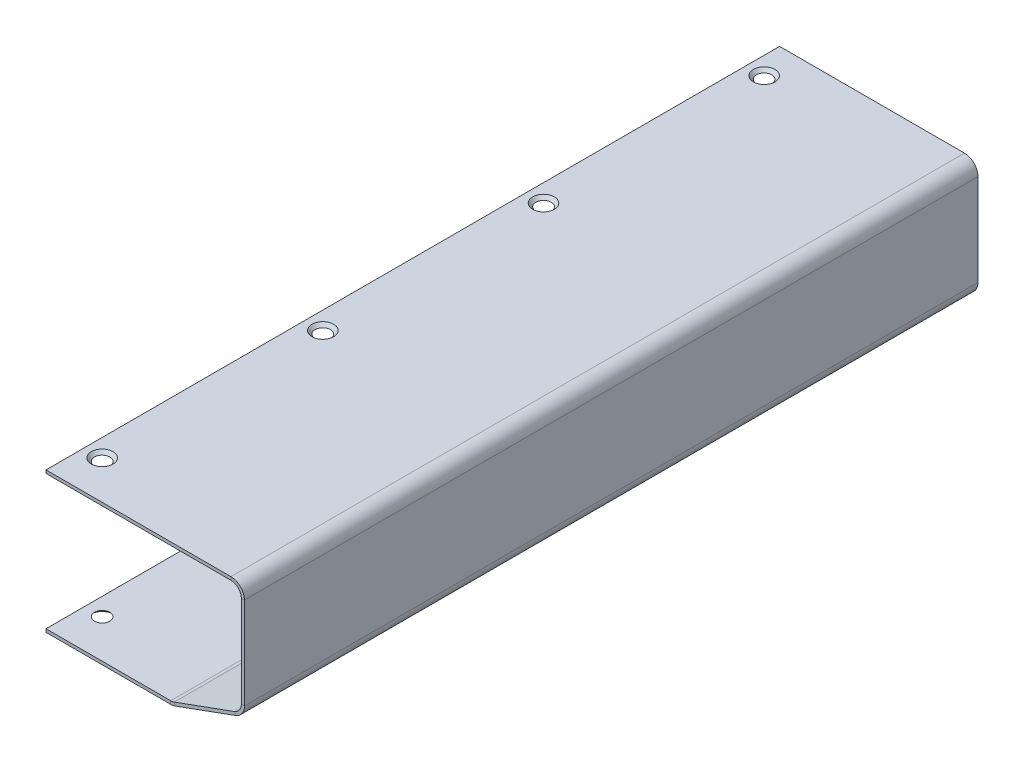
ISO-10303-21;
HEADER;
FILE_DESCRIPTION(('STEP AP214'),'2;1');
FILE_NAME('part.step','',(''),(''),'','','');
FILE_SCHEMA(('AUTOMOTIVE_DESIGN { 1 0 10303 214 1 1 1 1 }'));
ENDSEC;
DATA;
#1=APPLICATION_CONTEXT('core data for automotive mechanical design processes');
#2=APPLICATION_PROTOCOL_DEFINITION('international standard','automotive_design',2000,#1);
#3=PRODUCT_CONTEXT('',#1,'mechanical');
#4=PRODUCT('Part','Part','',(#3));
#5=PRODUCT_RELATED_PRODUCT_CATEGORY('part','',(#4));
#6=PRODUCT_DEFINITION_FORMATION('','',#4);
#7=PRODUCT_DEFINITION_CONTEXT('part definition',#1,'design');
#8=PRODUCT_DEFINITION('design','',#6,#7);
#9=PRODUCT_DEFINITION_SHAPE('','',#8);
#10=(LENGTH_UNIT() NAMED_UNIT(*) SI_UNIT(.MILLI.,.METRE.));
#11=(NAMED_UNIT(*) PLANE_ANGLE_UNIT() SI_UNIT($,.RADIAN.));
#12=(NAMED_UNIT(*) SI_UNIT($,.STERADIAN.) SOLID_ANGLE_UNIT());
#13=UNCERTAINTY_MEASURE_WITH_UNIT(LENGTH_MEASURE(1.E-05),#10,'distance_accuracy_value','');
#14=(GEOMETRIC_REPRESENTATION_CONTEXT(3) GLOBAL_UNCERTAINTY_ASSIGNED_CONTEXT((#13)) GLOBAL_UNIT_ASSIGNED_CONTEXT((#10,
#11,#12)) REPRESENTATION_CONTEXT('',''));
#15=CARTESIAN_POINT('',(0.,0.,0.));
#16=DIRECTION('',(0.,0.,1.));
#17=DIRECTION('',(1.,0.,0.));
#18=AXIS2_PLACEMENT_3D('',#15,#16,#17);
#19=CARTESIAN_POINT('',(4.12121612918239,-67.6307841407427,0.));
#20=DIRECTION('',(0.,1.,0.));
#21=DIRECTION('',(-1.,0.,0.));
#22=AXIS2_PLACEMENT_3D('',#19,#20,#21);
#23=PLANE('',#22);
#24=CARTESIAN_POINT('',(-239.30355885363,-67.6307841407444,-160.4));
#25=DIRECTION('',(0.,-1.,0.));
#26=DIRECTION('',(0.,0.,-1.));
#27=AXIS2_PLACEMENT_3D('',#24,#25,#26);
#28=CIRCLE('',#27,5.20000000000001);
#29=CARTESIAN_POINT('',(-239.30355885363,-67.6307841407444,-165.6));
#30=VERTEX_POINT('',#29);
#31=EDGE_CURVE('E828',#30,#30,#28,.T.);
#32=ORIENTED_EDGE('',*,*,#31,.F.);
#33=EDGE_LOOP('',(#32));
#34=FACE_BOUND('',#33,.T.);
#35=CARTESIAN_POINT('',(-239.30355885363,-67.6307841407444,-54.3333333333333));
#36=DIRECTION('',(0.,-1.,0.));
#37=DIRECTION('',(0.,0.,-1.));
#38=AXIS2_PLACEMENT_3D('',#35,#36,#37);
#39=CIRCLE('',#38,5.20000000000001);
#40=CARTESIAN_POINT('',(-239.30355885363,-67.6307841407444,-59.5333333333333));
#41=VERTEX_POINT('',#40);
#42=EDGE_CURVE('E398',#41,#41,#39,.T.);
#43=ORIENTED_EDGE('',*,*,#42,.F.);
#44=EDGE_LOOP('',(#43));
#45=FACE_BOUND('',#44,.T.);
#46=CARTESIAN_POINT('',(-239.30355885363,-67.6307841407444,51.7333333333334));
#47=DIRECTION('',(0.,-1.,0.));
#48=DIRECTION('',(0.,0.,-1.));
#49=AXIS2_PLACEMENT_3D('',#46,#47,#48);
#50=CIRCLE('',#49,5.20000000000001);
#51=CARTESIAN_POINT('',(-239.30355885363,-67.6307841407444,46.5333333333333));
#52=VERTEX_POINT('',#51);
#53=EDGE_CURVE('E387',#52,#52,#50,.T.);
#54=ORIENTED_EDGE('',*,*,#53,.F.);
#55=EDGE_LOOP('',(#54));
#56=FACE_BOUND('',#55,.T.);
#57=DIRECTION('',(0.,0.,1.));
#58=VECTOR('',#57,1.);
#59=CARTESIAN_POINT('',(-187.876719025511,-67.630784140744,-176.3));
#60=LINE('',#59,#58);
#61=CARTESIAN_POINT('',(-187.876719025511,-67.630784140744,176.3));
#62=VERTEX_POINT('',#61);
#63=CARTESIAN_POINT('',(-187.876719025511,-67.630784140744,-176.3));
#64=VERTEX_POINT('',#63);
#65=EDGE_CURVE('E248',#62,#64,#60,.F.);
#66=ORIENTED_EDGE('',*,*,#65,.F.);
#67=DIRECTION('',(-1.,0.,0.));
#68=VECTOR('',#67,1.);
#69=CARTESIAN_POINT('',(4.12121612918239,-67.6307841407427,176.3));
#70=LINE('',#69,#68);
#71=CARTESIAN_POINT('',(-247.80355885363,-67.6307841407444,176.3));
#72=VERTEX_POINT('',#71);
#73=EDGE_CURVE('E222',#62,#72,#70,.T.);
#74=ORIENTED_EDGE('',*,*,#73,.T.);
#75=DIRECTION('',(0.,0.,-1.));
#76=VECTOR('',#75,1.);
#77=CARTESIAN_POINT('',(-247.80355885363,-67.6307841407444,0.));
#78=LINE('',#77,#76);
#79=CARTESIAN_POINT('',(-247.80355885363,-67.6307841407444,-176.3));
#80=VERTEX_POINT('',#79);
#81=EDGE_CURVE('E215',#72,#80,#78,.T.);
#82=ORIENTED_EDGE('',*,*,#81,.T.);
#83=DIRECTION('',(1.,0.,0.));
#84=VECTOR('',#83,1.);
#85=CARTESIAN_POINT('',(4.12121612918239,-67.6307841407427,-176.3));
#86=LINE('',#85,#84);
#87=EDGE_CURVE('E220',#80,#64,#86,.T.);
#88=ORIENTED_EDGE('',*,*,#87,.T.);
#89=EDGE_LOOP('',(#66,#74,#82,#88));
#90=FACE_BOUND('',#89,.T.);
#91=CARTESIAN_POINT('',(-239.30355885363,-67.6307841407444,157.8));
#92=DIRECTION('',(0.,-1.,0.));
#93=DIRECTION('',(0.,0.,-1.));
#94=AXIS2_PLACEMENT_3D('',#91,#92,#93);
#95=CIRCLE('',#94,5.20000000000001);
#96=CARTESIAN_POINT('',(-239.30355885363,-67.6307841407444,152.6));
#97=VERTEX_POINT('',#96);
#98=EDGE_CURVE('E384',#97,#97,#95,.T.);
#99=ORIENTED_EDGE('',*,*,#98,.F.);
#100=EDGE_LOOP('',(#99));
#101=FACE_BOUND('',#100,.T.);
#102=ADVANCED_FACE('F100',(#34,#45,#56,#90,#101),#23,.F.);
#103=CARTESIAN_POINT('',(-153.410528638642,-55.503272272465,176.3));
#104=DIRECTION('',(0.,0.,1.));
#105=DIRECTION('',(1.,0.,0.));
#106=AXIS2_PLACEMENT_3D('',#103,#104,#105);
#107=PLANE('',#106);
#108=DIRECTION('',(-0.939692620785906,-0.342020143325676,0.));
#109=VECTOR('',#108,1.);
#110=CARTESIAN_POINT('',(-0.107214972633773,1.89083737505222,176.3));
#111=LINE('',#110,#109);
#112=CARTESIAN_POINT('',(-186.166618308882,-65.8292472446736,176.3));
#113=VERTEX_POINT('',#112);
#114=CARTESIAN_POINT('',(-157.213458137002,-55.2911587541671,176.3));
#115=VERTEX_POINT('',#114);
#116=EDGE_CURVE('E284',#113,#115,#111,.F.);
#117=ORIENTED_EDGE('',*,*,#116,.F.);
#118=DIRECTION('',(0.342020143325676,-0.939692620785906,0.));
#119=VECTOR('',#118,1.);
#120=CARTESIAN_POINT('',(-186.166618308882,-65.8292472446736,176.3));
#121=LINE('',#120,#119);
#122=CARTESIAN_POINT('',(-185.653588093894,-67.2387861758524,176.3));
#123=VERTEX_POINT('',#122);
#124=EDGE_CURVE('E262',#113,#123,#121,.T.);
#125=ORIENTED_EDGE('',*,*,#124,.T.);
#126=DIRECTION('',(0.939692620785906,0.342020143325676,0.));
#127=VECTOR('',#126,1.);
#128=CARTESIAN_POINT('',(-153.410528638642,-55.503272272465,176.3));
#129=LINE('',#128,#127);
#130=CARTESIAN_POINT('',(-156.700427922013,-56.700697685346,176.3));
#131=VERTEX_POINT('',#130);
#132=EDGE_CURVE('E278',#123,#131,#129,.T.);
#133=ORIENTED_EDGE('',*,*,#132,.T.);
#134=DIRECTION('',(0.342020143325676,-0.939692620785906,0.));
#135=VECTOR('',#134,1.);
#136=CARTESIAN_POINT('',(-157.213458137002,-55.2911587541671,176.3));
#137=LINE('',#136,#135);
#138=EDGE_CURVE('E292',#115,#131,#137,.T.);
#139=ORIENTED_EDGE('',*,*,#138,.F.);
#140=EDGE_LOOP('',(#117,#125,#133,#139));
#141=FACE_BOUND('',#140,.T.);
#142=ADVANCED_FACE('F449',(#141),#107,.T.);
#143=CARTESIAN_POINT('',(0.405815242354857,0.481298443873407,0.));
#144=DIRECTION('',(0.342020143325676,-0.939692620785906,0.));
#145=DIRECTION('',(0.939692620785906,0.342020143325676,0.));
#146=AXIS2_PLACEMENT_3D('',#143,#144,#145);
#147=PLANE('',#146);
#148=ORIENTED_EDGE('',*,*,#132,.F.);
#149=DIRECTION('',(0.,0.,1.));
#150=VECTOR('',#149,1.);
#151=CARTESIAN_POINT('',(-185.653588093894,-67.2387861758524,176.3));
#152=LINE('',#151,#150);
#153=CARTESIAN_POINT('',(-185.653588093894,-67.2387861758524,-176.3));
#154=VERTEX_POINT('',#153);
#155=EDGE_CURVE('E257',#123,#154,#152,.F.);
#156=ORIENTED_EDGE('',*,*,#155,.T.);
#157=DIRECTION('',(-0.939692620785906,-0.342020143325676,0.));
#158=VECTOR('',#157,1.);
#159=CARTESIAN_POINT('',(-190.603270036162,-69.0403230719229,-176.3));
#160=LINE('',#159,#158);
#161=CARTESIAN_POINT('',(-156.700427922013,-56.700697685346,-176.3));
#162=VERTEX_POINT('',#161);
#163=EDGE_CURVE('E281',#162,#154,#160,.T.);
#164=ORIENTED_EDGE('',*,*,#163,.F.);
#165=DIRECTION('',(0.,0.,1.));
#166=VECTOR('',#165,1.);
#167=CARTESIAN_POINT('',(-156.700427922013,-56.700697685346,0.));
#168=LINE('',#167,#166);
#169=EDGE_CURVE('E289',#162,#131,#168,.T.);
#170=ORIENTED_EDGE('',*,*,#169,.T.);
#171=EDGE_LOOP('',(#148,#156,#164,#170));
#172=FACE_BOUND('',#171,.T.);
#173=ADVANCED_FACE('F455',(#172),#147,.T.);
#174=CARTESIAN_POINT('',(-0.107214972633657,1.89083737505227,0.));
#175=DIRECTION('',(0.342020143325676,-0.939692620785906,0.));
#176=DIRECTION('',(0.939692620785906,0.342020143325676,0.));
#177=AXIS2_PLACEMENT_3D('',#174,#175,#176);
#178=PLANE('',#177);
#179=DIRECTION('',(0.,0.,1.));
#180=VECTOR('',#179,1.);
#181=CARTESIAN_POINT('',(-186.166618308882,-65.8292472446736,176.3));
#182=LINE('',#181,#180);
#183=CARTESIAN_POINT('',(-186.166618308882,-65.8292472446736,-176.3));
#184=VERTEX_POINT('',#183);
#185=EDGE_CURVE('E268',#113,#184,#182,.F.);
#186=ORIENTED_EDGE('',*,*,#185,.F.);
#187=ORIENTED_EDGE('',*,*,#116,.T.);
#188=DIRECTION('',(0.,0.,-1.));
#189=VECTOR('',#188,1.);
#190=CARTESIAN_POINT('',(-157.213458137002,-55.2911587541671,-176.3));
#191=LINE('',#190,#189);
#192=CARTESIAN_POINT('',(-157.213458137002,-55.2911587541671,-176.3));
#193=VERTEX_POINT('',#192);
#194=EDGE_CURVE('E295',#193,#115,#191,.F.);
#195=ORIENTED_EDGE('',*,*,#194,.F.);
#196=DIRECTION('',(0.939692620785906,0.342020143325676,0.));
#197=VECTOR('',#196,1.);
#198=CARTESIAN_POINT('',(-0.107214972633657,1.89083737505227,-176.3));
#199=LINE('',#198,#197);
#200=EDGE_CURVE('E286',#193,#184,#199,.F.);
#201=ORIENTED_EDGE('',*,*,#200,.T.);
#202=EDGE_LOOP('',(#186,#187,#195,#201));
#203=FACE_BOUND('',#202,.T.);
#204=ADVANCED_FACE('F537',(#203),#178,.F.);
#205=CARTESIAN_POINT('',(-152.42355885363,-1.49999999999999,176.3));
#206=DIRECTION('',(0.,0.,1.));
#207=DIRECTION('',(1.,0.,0.));
#208=AXIS2_PLACEMENT_3D('',#205,#206,#207);
#209=PLANE('',#208);
#210=DIRECTION('',(0.,-1.,0.));
#211=VECTOR('',#210,1.);
#212=CARTESIAN_POINT('',(-153.92355885363,-5.46488748727744E-13,176.3));
#213=LINE('',#212,#211);
#214=CARTESIAN_POINT('',(-153.92355885363,-50.5926956502376,176.3));
#215=VERTEX_POINT('',#214);
#216=CARTESIAN_POINT('',(-153.92355885363,-6.49999999999998,176.3));
#217=VERTEX_POINT('',#216);
#218=EDGE_CURVE('E326',#215,#217,#213,.F.);
#219=ORIENTED_EDGE('',*,*,#218,.F.);
#220=DIRECTION('',(1.,0.,0.));
#221=VECTOR('',#220,1.);
#222=CARTESIAN_POINT('',(-153.92355885363,-50.5926956502376,176.3));
#223=LINE('',#222,#221);
#224=CARTESIAN_POINT('',(-152.42355885363,-50.5926956502376,176.3));
#225=VERTEX_POINT('',#224);
#226=EDGE_CURVE('E305',#215,#225,#223,.T.);
#227=ORIENTED_EDGE('',*,*,#226,.T.);
#228=DIRECTION('',(0.,1.,0.));
#229=VECTOR('',#228,1.);
#230=CARTESIAN_POINT('',(-152.42355885363,-1.49999999999999,176.3));
#231=LINE('',#230,#229);
#232=CARTESIAN_POINT('',(-152.42355885363,-6.49999999999997,176.3));
#233=VERTEX_POINT('',#232);
#234=EDGE_CURVE('E320',#225,#233,#231,.T.);
#235=ORIENTED_EDGE('',*,*,#234,.T.);
#236=DIRECTION('',(1.,0.,0.));
#237=VECTOR('',#236,1.);
#238=CARTESIAN_POINT('',(-153.92355885363,-6.49999999999998,176.3));
#239=LINE('',#238,#237);
#240=EDGE_CURVE('E334',#217,#233,#239,.T.);
#241=ORIENTED_EDGE('',*,*,#240,.F.);
#242=EDGE_LOOP('',(#219,#227,#235,#241));
#243=FACE_BOUND('',#242,.T.);
#244=ADVANCED_FACE('F525',(#243),#209,.T.);
#245=CARTESIAN_POINT('',(-152.42355885363,-5.41251526719479E-13,0.));
#246=DIRECTION('',(1.,0.,0.));
#247=DIRECTION('',(0.,1.,0.));
#248=AXIS2_PLACEMENT_3D('',#245,#246,#247);
#249=PLANE('',#248);
#250=ORIENTED_EDGE('',*,*,#234,.F.);
#251=DIRECTION('',(0.,0.,1.));
#252=VECTOR('',#251,1.);
#253=CARTESIAN_POINT('',(-152.42355885363,-50.5926956502376,176.3));
#254=LINE('',#253,#252);
#255=CARTESIAN_POINT('',(-152.42355885363,-50.5926956502376,-176.3));
#256=VERTEX_POINT('',#255);
#257=EDGE_CURVE('E300',#225,#256,#254,.F.);
#258=ORIENTED_EDGE('',*,*,#257,.T.);
#259=DIRECTION('',(0.,-1.,0.));
#260=VECTOR('',#259,1.);
#261=CARTESIAN_POINT('',(-152.42355885363,-55.69,-176.3));
#262=LINE('',#261,#260);
#263=CARTESIAN_POINT('',(-152.42355885363,-6.49999999999997,-176.3));
#264=VERTEX_POINT('',#263);
#265=EDGE_CURVE('E323',#264,#256,#262,.T.);
#266=ORIENTED_EDGE('',*,*,#265,.F.);
#267=DIRECTION('',(0.,0.,1.));
#268=VECTOR('',#267,1.);
#269=CARTESIAN_POINT('',(-152.42355885363,-6.49999999999997,0.));
#270=LINE('',#269,#268);
#271=EDGE_CURVE('E331',#264,#233,#270,.T.);
#272=ORIENTED_EDGE('',*,*,#271,.T.);
#273=EDGE_LOOP('',(#250,#258,#266,#272));
#274=FACE_BOUND('',#273,.T.);
#275=ADVANCED_FACE('F515',(#274),#249,.T.);
#276=CARTESIAN_POINT('',(-153.92355885363,-5.46488748727744E-13,0.));
#277=DIRECTION('',(1.,0.,0.));
#278=DIRECTION('',(0.,1.,0.));
#279=AXIS2_PLACEMENT_3D('',#276,#277,#278);
#280=PLANE('',#279);
#281=DIRECTION('',(0.,0.,1.));
#282=VECTOR('',#281,1.);
#283=CARTESIAN_POINT('',(-153.92355885363,-50.5926956502376,176.3));
#284=LINE('',#283,#282);
#285=CARTESIAN_POINT('',(-153.92355885363,-50.5926956502376,-176.3));
#286=VERTEX_POINT('',#285);
#287=EDGE_CURVE('E311',#215,#286,#284,.F.);
#288=ORIENTED_EDGE('',*,*,#287,.F.);
#289=ORIENTED_EDGE('',*,*,#218,.T.);
#290=DIRECTION('',(0.,0.,-1.));
#291=VECTOR('',#290,1.);
#292=CARTESIAN_POINT('',(-153.92355885363,-6.49999999999998,-176.3));
#293=LINE('',#292,#291);
#294=CARTESIAN_POINT('',(-153.92355885363,-6.49999999999998,-176.3));
#295=VERTEX_POINT('',#294);
#296=EDGE_CURVE('E337',#295,#217,#293,.F.);
#297=ORIENTED_EDGE('',*,*,#296,.F.);
#298=DIRECTION('',(0.,1.,0.));
#299=VECTOR('',#298,1.);
#300=CARTESIAN_POINT('',(-153.92355885363,-5.46488748727744E-13,-176.3));
#301=LINE('',#300,#299);
#302=EDGE_CURVE('E328',#295,#286,#301,.F.);
#303=ORIENTED_EDGE('',*,*,#302,.T.);
#304=EDGE_LOOP('',(#288,#289,#297,#303));
#305=FACE_BOUND('',#304,.T.);
#306=ADVANCED_FACE('F524',(#305),#280,.F.);
#307=CARTESIAN_POINT('',(-247.80355885363,-1.5,176.3));
#308=DIRECTION('',(0.,0.,1.));
#309=DIRECTION('',(1.,0.,0.));
#310=AXIS2_PLACEMENT_3D('',#307,#308,#309);
#311=PLANE('',#310);
#312=DIRECTION('',(1.,0.,0.));
#313=VECTOR('',#312,1.);
#314=CARTESIAN_POINT('',(-247.80355885363,-1.5,176.3));
#315=LINE('',#314,#313);
#316=CARTESIAN_POINT('',(-247.80355885363,-1.5,176.3));
#317=VERTEX_POINT('',#316);
#318=CARTESIAN_POINT('',(-158.92355885363,-1.49999999999999,176.3));
#319=VERTEX_POINT('',#318);
#320=EDGE_CURVE('E368',#317,#319,#315,.T.);
#321=ORIENTED_EDGE('',*,*,#320,.T.);
#322=DIRECTION('',(0.,1.,0.));
#323=VECTOR('',#322,1.);
#324=CARTESIAN_POINT('',(-158.92355885363,-1.49999999999999,176.3));
#325=LINE('',#324,#323);
#326=CARTESIAN_POINT('',(-158.92355885363,0.,176.3));
#327=VERTEX_POINT('',#326);
#328=EDGE_CURVE('E349',#319,#327,#325,.T.);
#329=ORIENTED_EDGE('',*,*,#328,.T.);
#330=DIRECTION('',(1.,0.,0.));
#331=VECTOR('',#330,1.);
#332=CARTESIAN_POINT('',(-247.80355885363,0.,176.3));
#333=LINE('',#332,#331);
#334=CARTESIAN_POINT('',(-247.80355885363,0.,176.3));
#335=VERTEX_POINT('',#334);
#336=EDGE_CURVE('E376',#335,#327,#333,.T.);
#337=ORIENTED_EDGE('',*,*,#336,.F.);
#338=DIRECTION('',(0.,1.,0.));
#339=VECTOR('',#338,1.);
#340=CARTESIAN_POINT('',(-247.80355885363,-1.5,176.3));
#341=LINE('',#340,#339);
#342=EDGE_CURVE('E109',#317,#335,#341,.T.);
#343=ORIENTED_EDGE('',*,*,#342,.F.);
#344=EDGE_LOOP('',(#321,#329,#337,#343));
#345=FACE_BOUND('',#344,.T.);
#346=ADVANCED_FACE('F482',(#345),#311,.T.);
#347=CARTESIAN_POINT('',(0.,-1.5,0.));
#348=DIRECTION('',(0.,1.,0.));
#349=DIRECTION('',(0.,0.,1.));
#350=AXIS2_PLACEMENT_3D('',#347,#348,#349);
#351=PLANE('',#350);
#352=CARTESIAN_POINT('',(-239.30355885363,-1.5,-160.4));
#353=DIRECTION('',(0.,1.,0.));
#354=DIRECTION('',(0.,0.,1.));
#355=AXIS2_PLACEMENT_3D('',#352,#353,#354);
#356=CIRCLE('',#355,3.7);
#357=CARTESIAN_POINT('',(-239.30355885363,-1.5,-156.7));
#358=VERTEX_POINT('',#357);
#359=EDGE_CURVE('E404',#358,#358,#356,.T.);
#360=ORIENTED_EDGE('',*,*,#359,.T.);
#361=EDGE_LOOP('',(#360));
#362=FACE_BOUND('',#361,.T.);
#363=CARTESIAN_POINT('',(-239.30355885363,-1.5,-54.3333333333333));
#364=DIRECTION('',(0.,1.,0.));
#365=DIRECTION('',(0.,0.,1.));
#366=AXIS2_PLACEMENT_3D('',#363,#364,#365);
#367=CIRCLE('',#366,3.7);
#368=CARTESIAN_POINT('',(-239.30355885363,-1.5,-50.6333333333333));
#369=VERTEX_POINT('',#368);
#370=EDGE_CURVE('E410',#369,#369,#367,.T.);
#371=ORIENTED_EDGE('',*,*,#370,.T.);
#372=EDGE_LOOP('',(#371));
#373=FACE_BOUND('',#372,.T.);
#374=CARTESIAN_POINT('',(-239.30355885363,-1.5,51.7333333333334));
#375=DIRECTION('',(0.,1.,0.));
#376=DIRECTION('',(0.,0.,1.));
#377=AXIS2_PLACEMENT_3D('',#374,#375,#376);
#378=CIRCLE('',#377,3.7);
#379=CARTESIAN_POINT('',(-239.30355885363,-1.5,55.4333333333334));
#380=VERTEX_POINT('',#379);
#381=EDGE_CURVE('E416',#380,#380,#378,.T.);
#382=ORIENTED_EDGE('',*,*,#381,.T.);
#383=EDGE_LOOP('',(#382));
#384=FACE_BOUND('',#383,.T.);
#385=CARTESIAN_POINT('',(-239.30355885363,-1.5,157.8));
#386=DIRECTION('',(0.,1.,0.));
#387=DIRECTION('',(0.,0.,1.));
#388=AXIS2_PLACEMENT_3D('',#385,#386,#387);
#389=CIRCLE('',#388,3.7);
#390=CARTESIAN_POINT('',(-239.30355885363,-1.5,161.5));
#391=VERTEX_POINT('',#390);
#392=EDGE_CURVE('E256',#391,#391,#389,.T.);
#393=ORIENTED_EDGE('',*,*,#392,.T.);
#394=EDGE_LOOP('',(#393));
#395=FACE_BOUND('',#394,.T.);
#396=DIRECTION('',(0.,0.,1.));
#397=VECTOR('',#396,1.);
#398=CARTESIAN_POINT('',(-158.92355885363,-1.49999999999999,176.3));
#399=LINE('',#398,#397);
#400=CARTESIAN_POINT('',(-158.92355885363,-1.49999999999999,-176.3));
#401=VERTEX_POINT('',#400);
#402=EDGE_CURVE('E355',#319,#401,#399,.F.);
#403=ORIENTED_EDGE('',*,*,#402,.F.);
#404=ORIENTED_EDGE('',*,*,#320,.F.);
#405=DIRECTION('',(0.,0.,1.));
#406=VECTOR('',#405,1.);
#407=CARTESIAN_POINT('',(-247.80355885363,-1.5,-176.3));
#408=LINE('',#407,#406);
#409=CARTESIAN_POINT('',(-247.80355885363,-1.5,-176.3));
#410=VERTEX_POINT('',#409);
#411=EDGE_CURVE('E365',#410,#317,#408,.T.);
#412=ORIENTED_EDGE('',*,*,#411,.F.);
#413=DIRECTION('',(-1.,0.,0.));
#414=VECTOR('',#413,1.);
#415=CARTESIAN_POINT('',(-247.80355885363,-1.5,-176.3));
#416=LINE('',#415,#414);
#417=EDGE_CURVE('E372',#401,#410,#416,.T.);
#418=ORIENTED_EDGE('',*,*,#417,.F.);
#419=EDGE_LOOP('',(#403,#404,#412,#418));
#420=FACE_BOUND('',#419,.T.);
#421=ADVANCED_FACE('F478',(#362,#373,#384,#395,#420),#351,.F.);
#422=CARTESIAN_POINT('',(0.,0.,0.));
#423=DIRECTION('',(0.,1.,0.));
#424=DIRECTION('',(0.,0.,1.));
#425=AXIS2_PLACEMENT_3D('',#422,#423,#424);
#426=PLANE('',#425);
#427=CARTESIAN_POINT('',(-239.30355885363,0.,-160.4));
#428=DIRECTION('',(0.,1.,0.));
#429=DIRECTION('',(0.,0.,1.));
#430=AXIS2_PLACEMENT_3D('',#427,#428,#429);
#431=CIRCLE('',#430,5.20000000000001);
#432=CARTESIAN_POINT('',(-239.30355885363,0.,-155.2));
#433=VERTEX_POINT('',#432);
#434=EDGE_CURVE('E383',#433,#433,#431,.T.);
#435=ORIENTED_EDGE('',*,*,#434,.F.);
#436=EDGE_LOOP('',(#435));
#437=FACE_BOUND('',#436,.T.);
#438=CARTESIAN_POINT('',(-239.30355885363,0.,-54.3333333333333));
#439=DIRECTION('',(0.,1.,0.));
#440=DIRECTION('',(0.,0.,1.));
#441=AXIS2_PLACEMENT_3D('',#438,#439,#440);
#442=CIRCLE('',#441,5.20000000000001);
#443=CARTESIAN_POINT('',(-239.30355885363,0.,-49.1333333333333));
#444=VERTEX_POINT('',#443);
#445=EDGE_CURVE('E407',#444,#444,#442,.T.);
#446=ORIENTED_EDGE('',*,*,#445,.F.);
#447=EDGE_LOOP('',(#446));
#448=FACE_BOUND('',#447,.T.);
#449=CARTESIAN_POINT('',(-239.30355885363,0.,51.7333333333334));
#450=DIRECTION('',(0.,1.,0.));
#451=DIRECTION('',(0.,0.,1.));
#452=AXIS2_PLACEMENT_3D('',#449,#450,#451);
#453=CIRCLE('',#452,5.20000000000001);
#454=CARTESIAN_POINT('',(-239.30355885363,0.,56.9333333333334));
#455=VERTEX_POINT('',#454);
#456=EDGE_CURVE('E413',#455,#455,#453,.T.);
#457=ORIENTED_EDGE('',*,*,#456,.F.);
#458=EDGE_LOOP('',(#457));
#459=FACE_BOUND('',#458,.T.);
#460=CARTESIAN_POINT('',(-239.30355885363,0.,157.8));
#461=DIRECTION('',(0.,1.,0.));
#462=DIRECTION('',(0.,0.,1.));
#463=AXIS2_PLACEMENT_3D('',#460,#461,#462);
#464=CIRCLE('',#463,5.20000000000001);
#465=CARTESIAN_POINT('',(-239.30355885363,0.,163.));
#466=VERTEX_POINT('',#465);
#467=EDGE_CURVE('E419',#466,#466,#464,.T.);
#468=ORIENTED_EDGE('',*,*,#467,.F.);
#469=EDGE_LOOP('',(#468));
#470=FACE_BOUND('',#469,.T.);
#471=ORIENTED_EDGE('',*,*,#336,.T.);
#472=DIRECTION('',(0.,0.,1.));
#473=VECTOR('',#472,1.);
#474=CARTESIAN_POINT('',(-158.92355885363,0.,176.3));
#475=LINE('',#474,#473);
#476=CARTESIAN_POINT('',(-158.92355885363,0.,-176.3));
#477=VERTEX_POINT('',#476);
#478=EDGE_CURVE('E342',#327,#477,#475,.F.);
#479=ORIENTED_EDGE('',*,*,#478,.T.);
#480=DIRECTION('',(-1.,0.,0.));
#481=VECTOR('',#480,1.);
#482=CARTESIAN_POINT('',(-247.80355885363,0.,-176.3));
#483=LINE('',#482,#481);
#484=CARTESIAN_POINT('',(-247.80355885363,0.,-176.3));
#485=VERTEX_POINT('',#484);
#486=EDGE_CURVE('E369',#477,#485,#483,.T.);
#487=ORIENTED_EDGE('',*,*,#486,.T.);
#488=DIRECTION('',(0.,0.,1.));
#489=VECTOR('',#488,1.);
#490=CARTESIAN_POINT('',(-247.80355885363,0.,-176.3));
#491=LINE('',#490,#489);
#492=EDGE_CURVE('E362',#485,#335,#491,.T.);
#493=ORIENTED_EDGE('',*,*,#492,.T.);
#494=EDGE_LOOP('',(#471,#479,#487,#493));
#495=FACE_BOUND('',#494,.T.);
#496=ADVANCED_FACE('F481',(#437,#448,#459,#470,#495),#426,.T.);
#497=CARTESIAN_POINT('',(-247.80355885363,-1.5,-176.3));
#498=DIRECTION('',(-1.,0.,0.));
#499=DIRECTION('',(0.,0.,1.));
#500=AXIS2_PLACEMENT_3D('',#497,#498,#499);
#501=PLANE('',#500);
#502=ORIENTED_EDGE('',*,*,#492,.F.);
#503=DIRECTION('',(0.,1.,0.));
#504=VECTOR('',#503,1.);
#505=CARTESIAN_POINT('',(-247.80355885363,-1.5,-176.3));
#506=LINE('',#505,#504);
#507=EDGE_CURVE('E13',#410,#485,#506,.T.);
#508=ORIENTED_EDGE('',*,*,#507,.F.);
#509=ORIENTED_EDGE('',*,*,#411,.T.);
#510=ORIENTED_EDGE('',*,*,#342,.T.);
#511=EDGE_LOOP('',(#502,#508,#509,#510));
#512=FACE_BOUND('',#511,.T.);
#513=ADVANCED_FACE('F102',(#512),#501,.T.);
#514=CARTESIAN_POINT('',(-247.80355885363,-1.5,-176.3));
#515=DIRECTION('',(0.,0.,-1.));
#516=DIRECTION('',(-1.,0.,0.));
#517=AXIS2_PLACEMENT_3D('',#514,#515,#516);
#518=PLANE('',#517);
#519=DIRECTION('',(0.,1.,0.));
#520=VECTOR('',#519,1.);
#521=CARTESIAN_POINT('',(-158.92355885363,-1.49999999999999,-176.3));
#522=LINE('',#521,#520);
#523=EDGE_CURVE('E359',#401,#477,#522,.T.);
#524=ORIENTED_EDGE('',*,*,#523,.F.);
#525=ORIENTED_EDGE('',*,*,#417,.T.);
#526=ORIENTED_EDGE('',*,*,#507,.T.);
#527=ORIENTED_EDGE('',*,*,#486,.F.);
#528=EDGE_LOOP('',(#524,#525,#526,#527));
#529=FACE_BOUND('',#528,.T.);
#530=ADVANCED_FACE('F499',(#529),#518,.T.);
#531=CARTESIAN_POINT('',(-158.92355885363,-6.5,-176.3));
#532=DIRECTION('',(0.,0.,-1.));
#533=DIRECTION('',(-1.,0.,0.));
#534=AXIS2_PLACEMENT_3D('',#531,#532,#533);
#535=PLANE('',#534);
#536=DIRECTION('',(1.,0.,0.));
#537=VECTOR('',#536,1.);
#538=CARTESIAN_POINT('',(-152.42355885363,-6.49999999999997,-176.3));
#539=LINE('',#538,#537);
#540=EDGE_CURVE('E317',#295,#264,#539,.T.);
#541=ORIENTED_EDGE('',*,*,#540,.F.);
#542=CARTESIAN_POINT('',(-158.92355885363,-6.5,-176.3));
#543=DIRECTION('',(0.,0.,1.));
#544=DIRECTION('',(1.,0.,0.));
#545=AXIS2_PLACEMENT_3D('',#542,#543,#544);
#546=CIRCLE('',#545,5.);
#547=EDGE_CURVE('E352',#401,#295,#546,.F.);
#548=ORIENTED_EDGE('',*,*,#547,.F.);
#549=ORIENTED_EDGE('',*,*,#523,.T.);
#550=CARTESIAN_POINT('',(-158.92355885363,-6.5,-176.3));
#551=DIRECTION('',(0.,0.,1.));
#552=DIRECTION('',(1.,0.,0.));
#553=AXIS2_PLACEMENT_3D('',#550,#551,#552);
#554=CIRCLE('',#553,6.5);
#555=EDGE_CURVE('E345',#477,#264,#554,.F.);
#556=ORIENTED_EDGE('',*,*,#555,.T.);
#557=EDGE_LOOP('',(#541,#548,#549,#556));
#558=FACE_BOUND('',#557,.T.);
#559=ADVANCED_FACE('F501',(#558),#535,.T.);
#560=CARTESIAN_POINT('',(-158.92355885363,-6.5,176.3));
#561=DIRECTION('',(0.,0.,-1.));
#562=DIRECTION('',(-1.,0.,0.));
#563=AXIS2_PLACEMENT_3D('',#560,#561,#562);
#564=PLANE('',#563);
#565=CARTESIAN_POINT('',(-158.92355885363,-6.5,176.3));
#566=DIRECTION('',(0.,0.,1.));
#567=DIRECTION('',(1.,0.,0.));
#568=AXIS2_PLACEMENT_3D('',#565,#566,#567);
#569=CIRCLE('',#568,5.);
#570=EDGE_CURVE('E322',#217,#319,#569,.T.);
#571=ORIENTED_EDGE('',*,*,#570,.F.);
#572=ORIENTED_EDGE('',*,*,#240,.T.);
#573=CARTESIAN_POINT('',(-158.92355885363,-6.5,176.3));
#574=DIRECTION('',(0.,0.,1.));
#575=DIRECTION('',(1.,0.,0.));
#576=AXIS2_PLACEMENT_3D('',#573,#574,#575);
#577=CIRCLE('',#576,6.5);
#578=EDGE_CURVE('E346',#233,#327,#577,.T.);
#579=ORIENTED_EDGE('',*,*,#578,.T.);
#580=ORIENTED_EDGE('',*,*,#328,.F.);
#581=EDGE_LOOP('',(#571,#572,#579,#580));
#582=FACE_BOUND('',#581,.T.);
#583=ADVANCED_FACE('F508',(#582),#564,.F.);
#584=CARTESIAN_POINT('',(-158.92355885363,-6.5,176.3));
#585=DIRECTION('',(0.,0.,1.));
#586=DIRECTION('',(1.,0.,0.));
#587=AXIS2_PLACEMENT_3D('',#584,#585,#586);
#588=CYLINDRICAL_SURFACE('',#587,6.5);
#589=ORIENTED_EDGE('',*,*,#478,.F.);
#590=ORIENTED_EDGE('',*,*,#578,.F.);
#591=ORIENTED_EDGE('',*,*,#271,.F.);
#592=ORIENTED_EDGE('',*,*,#555,.F.);
#593=EDGE_LOOP('',(#589,#590,#591,#592));
#594=FACE_BOUND('',#593,.T.);
#595=ADVANCED_FACE('F505',(#594),#588,.T.);
#596=CARTESIAN_POINT('',(-158.92355885363,-6.5,176.3));
#597=DIRECTION('',(0.,0.,1.));
#598=DIRECTION('',(1.,0.,0.));
#599=AXIS2_PLACEMENT_3D('',#596,#597,#598);
#600=CYLINDRICAL_SURFACE('',#599,5.);
#601=ORIENTED_EDGE('',*,*,#402,.T.);
#602=ORIENTED_EDGE('',*,*,#547,.T.);
#603=ORIENTED_EDGE('',*,*,#296,.T.);
#604=ORIENTED_EDGE('',*,*,#570,.T.);
#605=EDGE_LOOP('',(#601,#602,#603,#604));
#606=FACE_BOUND('',#605,.T.);
#607=ADVANCED_FACE('F521',(#606),#600,.F.);
#608=CARTESIAN_POINT('',(-152.42355885363,-55.69,-176.3));
#609=DIRECTION('',(0.,0.,-1.));
#610=DIRECTION('',(-1.,0.,0.));
#611=AXIS2_PLACEMENT_3D('',#608,#609,#610);
#612=PLANE('',#611);
#613=DIRECTION('',(1.,0.,0.));
#614=VECTOR('',#613,1.);
#615=CARTESIAN_POINT('',(-153.92355885363,-50.5926956502376,-176.3));
#616=LINE('',#615,#614);
#617=EDGE_CURVE('E315',#286,#256,#616,.T.);
#618=ORIENTED_EDGE('',*,*,#617,.F.);
#619=ORIENTED_EDGE('',*,*,#302,.F.);
#620=ORIENTED_EDGE('',*,*,#540,.T.);
#621=ORIENTED_EDGE('',*,*,#265,.T.);
#622=EDGE_LOOP('',(#618,#619,#620,#621));
#623=FACE_BOUND('',#622,.T.);
#624=ADVANCED_FACE('F518',(#623),#612,.T.);
#625=CARTESIAN_POINT('',(-158.92355885363,-50.5926956502376,-176.3));
#626=DIRECTION('',(0.,0.,-1.));
#627=DIRECTION('',(-1.,0.,0.));
#628=AXIS2_PLACEMENT_3D('',#625,#626,#627);
#629=PLANE('',#628);
#630=DIRECTION('',(0.342020143325676,-0.939692620785906,0.));
#631=VECTOR('',#630,1.);
#632=CARTESIAN_POINT('',(-156.700427922013,-56.700697685346,-176.3));
#633=LINE('',#632,#631);
#634=EDGE_CURVE('E275',#193,#162,#633,.T.);
#635=ORIENTED_EDGE('',*,*,#634,.F.);
#636=CARTESIAN_POINT('',(-158.92355885363,-50.5926956502376,-176.3));
#637=DIRECTION('',(0.,0.,1.));
#638=DIRECTION('',(1.,0.,0.));
#639=AXIS2_PLACEMENT_3D('',#636,#637,#638);
#640=CIRCLE('',#639,5.00000000000001);
#641=EDGE_CURVE('E308',#286,#193,#640,.F.);
#642=ORIENTED_EDGE('',*,*,#641,.F.);
#643=ORIENTED_EDGE('',*,*,#617,.T.);
#644=CARTESIAN_POINT('',(-158.92355885363,-50.5926956502376,-176.3));
#645=DIRECTION('',(0.,0.,1.));
#646=DIRECTION('',(1.,0.,0.));
#647=AXIS2_PLACEMENT_3D('',#644,#645,#646);
#648=CIRCLE('',#647,6.50000000000001);
#649=EDGE_CURVE('E125',#256,#162,#648,.F.);
#650=ORIENTED_EDGE('',*,*,#649,.T.);
#651=EDGE_LOOP('',(#635,#642,#643,#650));
#652=FACE_BOUND('',#651,.T.);
#653=ADVANCED_FACE('F550',(#652),#629,.T.);
#654=CARTESIAN_POINT('',(-158.92355885363,-50.5926956502376,176.3));
#655=DIRECTION('',(0.,0.,-1.));
#656=DIRECTION('',(-1.,0.,0.));
#657=AXIS2_PLACEMENT_3D('',#654,#655,#656);
#658=PLANE('',#657);
#659=CARTESIAN_POINT('',(-158.92355885363,-50.5926956502376,176.3));
#660=DIRECTION('',(0.,0.,1.));
#661=DIRECTION('',(1.,0.,0.));
#662=AXIS2_PLACEMENT_3D('',#659,#660,#661);
#663=CIRCLE('',#662,5.00000000000001);
#664=EDGE_CURVE('E280',#115,#215,#663,.T.);
#665=ORIENTED_EDGE('',*,*,#664,.F.);
#666=ORIENTED_EDGE('',*,*,#138,.T.);
#667=CARTESIAN_POINT('',(-158.92355885363,-50.5926956502376,176.3));
#668=DIRECTION('',(0.,0.,1.));
#669=DIRECTION('',(1.,0.,0.));
#670=AXIS2_PLACEMENT_3D('',#667,#668,#669);
#671=CIRCLE('',#670,6.50000000000001);
#672=EDGE_CURVE('E303',#131,#225,#671,.T.);
#673=ORIENTED_EDGE('',*,*,#672,.T.);
#674=ORIENTED_EDGE('',*,*,#226,.F.);
#675=EDGE_LOOP('',(#665,#666,#673,#674));
#676=FACE_BOUND('',#675,.T.);
#677=ADVANCED_FACE('F528',(#676),#658,.F.);
#678=CARTESIAN_POINT('',(-158.92355885363,-50.5926956502376,176.3));
#679=DIRECTION('',(0.,0.,1.));
#680=DIRECTION('',(0.342020143325676,-0.939692620785906,0.));
#681=AXIS2_PLACEMENT_3D('',#678,#679,#680);
#682=CYLINDRICAL_SURFACE('',#681,6.50000000000001);
#683=ORIENTED_EDGE('',*,*,#257,.F.);
#684=ORIENTED_EDGE('',*,*,#672,.F.);
#685=ORIENTED_EDGE('',*,*,#169,.F.);
#686=ORIENTED_EDGE('',*,*,#649,.F.);
#687=EDGE_LOOP('',(#683,#684,#685,#686));
#688=FACE_BOUND('',#687,.T.);
#689=ADVANCED_FACE('F548',(#688),#682,.T.);
#690=CARTESIAN_POINT('',(-158.92355885363,-50.5926956502376,176.3));
#691=DIRECTION('',(0.,0.,1.));
#692=DIRECTION('',(0.342020143325676,-0.939692620785906,0.));
#693=AXIS2_PLACEMENT_3D('',#690,#691,#692);
#694=CYLINDRICAL_SURFACE('',#693,5.00000000000001);
#695=ORIENTED_EDGE('',*,*,#287,.T.);
#696=ORIENTED_EDGE('',*,*,#641,.T.);
#697=ORIENTED_EDGE('',*,*,#194,.T.);
#698=ORIENTED_EDGE('',*,*,#664,.T.);
#699=EDGE_LOOP('',(#695,#696,#697,#698));
#700=FACE_BOUND('',#699,.T.);
#701=ADVANCED_FACE('F532',(#700),#694,.F.);
#702=CARTESIAN_POINT('',(-190.603270036162,-69.0403230719229,-176.3));
#703=DIRECTION('',(0.,0.,-1.));
#704=DIRECTION('',(-1.,0.,0.));
#705=AXIS2_PLACEMENT_3D('',#702,#703,#704);
#706=PLANE('',#705);
#707=DIRECTION('',(0.342020143325676,-0.939692620785906,0.));
#708=VECTOR('',#707,1.);
#709=CARTESIAN_POINT('',(-186.166618308882,-65.8292472446736,-176.3));
#710=LINE('',#709,#708);
#711=EDGE_CURVE('E273',#184,#154,#710,.T.);
#712=ORIENTED_EDGE('',*,*,#711,.F.);
#713=ORIENTED_EDGE('',*,*,#200,.F.);
#714=ORIENTED_EDGE('',*,*,#634,.T.);
#715=ORIENTED_EDGE('',*,*,#163,.T.);
#716=EDGE_LOOP('',(#712,#713,#714,#715));
#717=FACE_BOUND('',#716,.T.);
#718=ADVANCED_FACE('F541',(#717),#706,.T.);
#719=CARTESIAN_POINT('',(-187.876719025511,-61.130784140744,-176.3));
#720=DIRECTION('',(0.,0.,-1.));
#721=DIRECTION('',(-1.,0.,0.));
#722=AXIS2_PLACEMENT_3D('',#719,#720,#721);
#723=PLANE('',#722);
#724=DIRECTION('',(0.,1.,0.));
#725=VECTOR('',#724,1.);
#726=CARTESIAN_POINT('',(-187.876719025511,-67.630784140744,-176.3));
#727=LINE('',#726,#725);
#728=CARTESIAN_POINT('',(-187.876719025511,-66.130784140744,-176.3));
#729=VERTEX_POINT('',#728);
#730=EDGE_CURVE('E239',#729,#64,#727,.F.);
#731=ORIENTED_EDGE('',*,*,#730,.F.);
#732=CARTESIAN_POINT('',(-187.876719025511,-61.130784140744,-176.3));
#733=DIRECTION('',(0.,0.,1.));
#734=DIRECTION('',(1.,0.,0.));
#735=AXIS2_PLACEMENT_3D('',#732,#733,#734);
#736=CIRCLE('',#735,5.00000000000002);
#737=EDGE_CURVE('E265',#184,#729,#736,.F.);
#738=ORIENTED_EDGE('',*,*,#737,.F.);
#739=ORIENTED_EDGE('',*,*,#711,.T.);
#740=CARTESIAN_POINT('',(-187.876719025511,-61.130784140744,-176.3));
#741=DIRECTION('',(0.,0.,1.));
#742=DIRECTION('',(1.,0.,0.));
#743=AXIS2_PLACEMENT_3D('',#740,#741,#742);
#744=CIRCLE('',#743,6.50000000000002);
#745=EDGE_CURVE('E117',#154,#64,#744,.F.);
#746=ORIENTED_EDGE('',*,*,#745,.T.);
#747=EDGE_LOOP('',(#731,#738,#739,#746));
#748=FACE_BOUND('',#747,.T.);
#749=ADVANCED_FACE('F544',(#748),#723,.T.);
#750=CARTESIAN_POINT('',(-187.876719025511,-61.130784140744,176.3));
#751=DIRECTION('',(0.,0.,-1.));
#752=DIRECTION('',(-1.,0.,0.));
#753=AXIS2_PLACEMENT_3D('',#750,#751,#752);
#754=PLANE('',#753);
#755=CARTESIAN_POINT('',(-187.876719025511,-61.130784140744,176.3));
#756=DIRECTION('',(0.,0.,1.));
#757=DIRECTION('',(1.,0.,0.));
#758=AXIS2_PLACEMENT_3D('',#755,#756,#757);
#759=CIRCLE('',#758,5.00000000000002);
#760=CARTESIAN_POINT('',(-187.876719025511,-66.130784140744,176.3));
#761=VERTEX_POINT('',#760);
#762=EDGE_CURVE('E270',#761,#113,#759,.T.);
#763=ORIENTED_EDGE('',*,*,#762,.F.);
#764=DIRECTION('',(0.,1.,0.));
#765=VECTOR('',#764,1.);
#766=CARTESIAN_POINT('',(-187.876719025511,-66.130784140744,176.3));
#767=LINE('',#766,#765);
#768=EDGE_CURVE('E250',#761,#62,#767,.F.);
#769=ORIENTED_EDGE('',*,*,#768,.T.);
#770=CARTESIAN_POINT('',(-187.876719025511,-61.130784140744,176.3));
#771=DIRECTION('',(0.,0.,1.));
#772=DIRECTION('',(1.,0.,0.));
#773=AXIS2_PLACEMENT_3D('',#770,#771,#772);
#774=CIRCLE('',#773,6.50000000000002);
#775=EDGE_CURVE('E260',#62,#123,#774,.T.);
#776=ORIENTED_EDGE('',*,*,#775,.T.);
#777=ORIENTED_EDGE('',*,*,#124,.F.);
#778=EDGE_LOOP('',(#763,#769,#776,#777));
#779=FACE_BOUND('',#778,.T.);
#780=ADVANCED_FACE('F436',(#779),#754,.F.);
#781=CARTESIAN_POINT('',(-187.876719025511,-61.130784140744,176.3));
#782=DIRECTION('',(0.,0.,1.));
#783=DIRECTION('',(0.,-1.,0.));
#784=AXIS2_PLACEMENT_3D('',#781,#782,#783);
#785=CYLINDRICAL_SURFACE('',#784,6.50000000000002);
#786=ORIENTED_EDGE('',*,*,#155,.F.);
#787=ORIENTED_EDGE('',*,*,#775,.F.);
#788=ORIENTED_EDGE('',*,*,#65,.T.);
#789=ORIENTED_EDGE('',*,*,#745,.F.);
#790=EDGE_LOOP('',(#786,#787,#788,#789));
#791=FACE_BOUND('',#790,.T.);
#792=ADVANCED_FACE('F547',(#791),#785,.T.);
#793=CARTESIAN_POINT('',(-187.876719025511,-61.130784140744,176.3));
#794=DIRECTION('',(0.,0.,1.));
#795=DIRECTION('',(0.,-1.,0.));
#796=AXIS2_PLACEMENT_3D('',#793,#794,#795);
#797=CYLINDRICAL_SURFACE('',#796,5.00000000000002);
#798=ORIENTED_EDGE('',*,*,#185,.T.);
#799=ORIENTED_EDGE('',*,*,#737,.T.);
#800=DIRECTION('',(0.,0.,1.));
#801=VECTOR('',#800,1.);
#802=CARTESIAN_POINT('',(-187.876719025511,-66.130784140744,-176.3));
#803=LINE('',#802,#801);
#804=EDGE_CURVE('E253',#729,#761,#803,.T.);
#805=ORIENTED_EDGE('',*,*,#804,.T.);
#806=ORIENTED_EDGE('',*,*,#762,.T.);
#807=EDGE_LOOP('',(#798,#799,#805,#806));
#808=FACE_BOUND('',#807,.T.);
#809=ADVANCED_FACE('F431',(#808),#797,.F.);
#810=CARTESIAN_POINT('',(-186.995084121968,-67.630784140744,-176.3));
#811=DIRECTION('',(0.,0.,1.));
#812=DIRECTION('',(1.,0.,0.));
#813=AXIS2_PLACEMENT_3D('',#810,#811,#812);
#814=PLANE('',#813);
#815=ORIENTED_EDGE('',*,*,#730,.T.);
#816=ORIENTED_EDGE('',*,*,#87,.F.);
#817=DIRECTION('',(0.,1.,0.));
#818=VECTOR('',#817,1.);
#819=CARTESIAN_POINT('',(-247.80355885363,-67.6307841407444,-176.3));
#820=LINE('',#819,#818);
#821=CARTESIAN_POINT('',(-247.80355885363,-66.1307841407444,-176.3));
#822=VERTEX_POINT('',#821);
#823=EDGE_CURVE('E226',#80,#822,#820,.T.);
#824=ORIENTED_EDGE('',*,*,#823,.T.);
#825=DIRECTION('',(-1.,0.,0.));
#826=VECTOR('',#825,1.);
#827=CARTESIAN_POINT('',(-186.995084121968,-66.130784140744,-176.3));
#828=LINE('',#827,#826);
#829=EDGE_CURVE('E246',#822,#729,#828,.F.);
#830=ORIENTED_EDGE('',*,*,#829,.T.);
#831=EDGE_LOOP('',(#815,#816,#824,#830));
#832=FACE_BOUND('',#831,.T.);
#833=ADVANCED_FACE('F238',(#832),#814,.F.);
#834=CARTESIAN_POINT('',(-247.80355885363,-67.6307841407444,176.3));
#835=DIRECTION('',(0.,0.,-1.));
#836=DIRECTION('',(-1.,0.,0.));
#837=AXIS2_PLACEMENT_3D('',#834,#835,#836);
#838=PLANE('',#837);
#839=ORIENTED_EDGE('',*,*,#768,.F.);
#840=DIRECTION('',(1.,0.,0.));
#841=VECTOR('',#840,1.);
#842=CARTESIAN_POINT('',(-247.80355885363,-66.1307841407444,176.3));
#843=LINE('',#842,#841);
#844=CARTESIAN_POINT('',(-247.80355885363,-66.1307841407444,176.3));
#845=VERTEX_POINT('',#844);
#846=EDGE_CURVE('E242',#761,#845,#843,.F.);
#847=ORIENTED_EDGE('',*,*,#846,.T.);
#848=DIRECTION('',(0.,1.,0.));
#849=VECTOR('',#848,1.);
#850=CARTESIAN_POINT('',(-247.80355885363,-67.6307841407444,176.3));
#851=LINE('',#850,#849);
#852=EDGE_CURVE('E235',#72,#845,#851,.T.);
#853=ORIENTED_EDGE('',*,*,#852,.F.);
#854=ORIENTED_EDGE('',*,*,#73,.F.);
#855=EDGE_LOOP('',(#839,#847,#853,#854));
#856=FACE_BOUND('',#855,.T.);
#857=ADVANCED_FACE('F437',(#856),#838,.F.);
#858=CARTESIAN_POINT('',(4.12121612918238,-66.1307841407427,0.));
#859=DIRECTION('',(0.,1.,0.));
#860=DIRECTION('',(-1.,0.,0.));
#861=AXIS2_PLACEMENT_3D('',#858,#859,#860);
#862=PLANE('',#861);
#863=CARTESIAN_POINT('',(-239.303558853631,-66.1307841407444,-160.4));
#864=DIRECTION('',(0.,1.,0.));
#865=DIRECTION('',(-1.,0.,0.));
#866=AXIS2_PLACEMENT_3D('',#863,#864,#865);
#867=CIRCLE('',#866,3.69999999999998);
#868=CARTESIAN_POINT('',(-243.00355885363,-66.1307841407444,-160.4));
#869=VERTEX_POINT('',#868);
#870=EDGE_CURVE('E104',#869,#869,#867,.T.);
#871=ORIENTED_EDGE('',*,*,#870,.F.);
#872=EDGE_LOOP('',(#871));
#873=FACE_BOUND('',#872,.T.);
#874=CARTESIAN_POINT('',(-239.303558853631,-66.1307841407444,-54.3333333333333));
#875=DIRECTION('',(0.,1.,0.));
#876=DIRECTION('',(-1.,0.,0.));
#877=AXIS2_PLACEMENT_3D('',#874,#875,#876);
#878=CIRCLE('',#877,3.69999999999998);
#879=CARTESIAN_POINT('',(-243.00355885363,-66.1307841407444,-54.3333333333333));
#880=VERTEX_POINT('',#879);
#881=EDGE_CURVE('E393',#880,#880,#878,.T.);
#882=ORIENTED_EDGE('',*,*,#881,.F.);
#883=EDGE_LOOP('',(#882));
#884=FACE_BOUND('',#883,.T.);
#885=CARTESIAN_POINT('',(-239.303558853631,-66.1307841407444,51.7333333333334));
#886=DIRECTION('',(0.,1.,0.));
#887=DIRECTION('',(-1.,0.,0.));
#888=AXIS2_PLACEMENT_3D('',#885,#886,#887);
#889=CIRCLE('',#888,3.69999999999998);
#890=CARTESIAN_POINT('',(-243.00355885363,-66.1307841407444,51.7333333333334));
#891=VERTEX_POINT('',#890);
#892=EDGE_CURVE('E385',#891,#891,#889,.T.);
#893=ORIENTED_EDGE('',*,*,#892,.F.);
#894=EDGE_LOOP('',(#893));
#895=FACE_BOUND('',#894,.T.);
#896=CARTESIAN_POINT('',(-239.303558853631,-66.1307841407444,157.8));
#897=DIRECTION('',(0.,1.,0.));
#898=DIRECTION('',(-1.,0.,0.));
#899=AXIS2_PLACEMENT_3D('',#896,#897,#898);
#900=CIRCLE('',#899,3.69999999999998);
#901=CARTESIAN_POINT('',(-243.00355885363,-66.1307841407444,157.8));
#902=VERTEX_POINT('',#901);
#903=EDGE_CURVE('E381',#902,#902,#900,.T.);
#904=ORIENTED_EDGE('',*,*,#903,.F.);
#905=EDGE_LOOP('',(#904));
#906=FACE_BOUND('',#905,.T.);
#907=ORIENTED_EDGE('',*,*,#846,.F.);
#908=ORIENTED_EDGE('',*,*,#804,.F.);
#909=ORIENTED_EDGE('',*,*,#829,.F.);
#910=DIRECTION('',(0.,0.,1.));
#911=VECTOR('',#910,1.);
#912=CARTESIAN_POINT('',(-247.80355885363,-66.1307841407444,-176.3));
#913=LINE('',#912,#911);
#914=EDGE_CURVE('E231',#845,#822,#913,.F.);
#915=ORIENTED_EDGE('',*,*,#914,.F.);
#916=EDGE_LOOP('',(#907,#908,#909,#915));
#917=FACE_BOUND('',#916,.T.);
#918=ADVANCED_FACE('F427',(#873,#884,#895,#906,#917),#862,.T.);
#919=CARTESIAN_POINT('',(-247.80355885363,-67.6307841407444,-176.3));
#920=DIRECTION('',(1.,0.,0.));
#921=DIRECTION('',(0.,1.,0.));
#922=AXIS2_PLACEMENT_3D('',#919,#920,#921);
#923=PLANE('',#922);
#924=ORIENTED_EDGE('',*,*,#914,.T.);
#925=ORIENTED_EDGE('',*,*,#823,.F.);
#926=ORIENTED_EDGE('',*,*,#81,.F.);
#927=ORIENTED_EDGE('',*,*,#852,.T.);
#928=EDGE_LOOP('',(#924,#925,#926,#927));
#929=FACE_BOUND('',#928,.T.);
#930=ADVANCED_FACE('F229',(#929),#923,.F.);
#931=CARTESIAN_POINT('',(-239.30355885363,0.,157.8));
#932=DIRECTION('',(0.,1.,0.));
#933=DIRECTION('',(0.,0.,1.));
#934=AXIS2_PLACEMENT_3D('',#931,#932,#933);
#935=CONICAL_SURFACE('',#934,5.20000000000001,0.78539816339745);
#936=ORIENTED_EDGE('',*,*,#467,.T.);
#937=EDGE_LOOP('',(#936));
#938=FACE_BOUND('',#937,.T.);
#939=ORIENTED_EDGE('',*,*,#392,.F.);
#940=EDGE_LOOP('',(#939));
#941=FACE_BOUND('',#940,.T.);
#942=ADVANCED_FACE('F461',(#938,#941),#935,.F.);
#943=CARTESIAN_POINT('',(-239.30355885363,0.,51.7333333333334));
#944=DIRECTION('',(0.,1.,0.));
#945=DIRECTION('',(0.,0.,1.));
#946=AXIS2_PLACEMENT_3D('',#943,#944,#945);
#947=CONICAL_SURFACE('',#946,5.20000000000001,0.78539816339745);
#948=ORIENTED_EDGE('',*,*,#456,.T.);
#949=EDGE_LOOP('',(#948));
#950=FACE_BOUND('',#949,.T.);
#951=ORIENTED_EDGE('',*,*,#381,.F.);
#952=EDGE_LOOP('',(#951));
#953=FACE_BOUND('',#952,.T.);
#954=ADVANCED_FACE('F467',(#950,#953),#947,.F.);
#955=CARTESIAN_POINT('',(-239.30355885363,0.,-54.3333333333333));
#956=DIRECTION('',(0.,1.,0.));
#957=DIRECTION('',(0.,0.,1.));
#958=AXIS2_PLACEMENT_3D('',#955,#956,#957);
#959=CONICAL_SURFACE('',#958,5.20000000000001,0.78539816339745);
#960=ORIENTED_EDGE('',*,*,#445,.T.);
#961=EDGE_LOOP('',(#960));
#962=FACE_BOUND('',#961,.T.);
#963=ORIENTED_EDGE('',*,*,#370,.F.);
#964=EDGE_LOOP('',(#963));
#965=FACE_BOUND('',#964,.T.);
#966=ADVANCED_FACE('F472',(#962,#965),#959,.F.);
#967=CARTESIAN_POINT('',(-239.30355885363,0.,-160.4));
#968=DIRECTION('',(0.,1.,0.));
#969=DIRECTION('',(0.,0.,1.));
#970=AXIS2_PLACEMENT_3D('',#967,#968,#969);
#971=CONICAL_SURFACE('',#970,5.20000000000001,0.78539816339745);
#972=ORIENTED_EDGE('',*,*,#434,.T.);
#973=EDGE_LOOP('',(#972));
#974=FACE_BOUND('',#973,.T.);
#975=ORIENTED_EDGE('',*,*,#359,.F.);
#976=EDGE_LOOP('',(#975));
#977=FACE_BOUND('',#976,.T.);
#978=ADVANCED_FACE('F767',(#974,#977),#971,.F.);
#979=CARTESIAN_POINT('',(-239.30355885363,-67.6307841407444,157.8));
#980=DIRECTION('',(0.,-1.,0.));
#981=DIRECTION('',(0.,0.,-1.));
#982=AXIS2_PLACEMENT_3D('',#979,#980,#981);
#983=CONICAL_SURFACE('',#982,5.20000000000001,0.785398163397454);
#984=ORIENTED_EDGE('',*,*,#903,.T.);
#985=EDGE_LOOP('',(#984));
#986=FACE_BOUND('',#985,.T.);
#987=ORIENTED_EDGE('',*,*,#98,.T.);
#988=EDGE_LOOP('',(#987));
#989=FACE_BOUND('',#988,.T.);
#990=ADVANCED_FACE('F776',(#986,#989),#983,.F.);
#991=CARTESIAN_POINT('',(-239.30355885363,-67.6307841407444,51.7333333333334));
#992=DIRECTION('',(0.,-1.,0.));
#993=DIRECTION('',(0.,0.,-1.));
#994=AXIS2_PLACEMENT_3D('',#991,#992,#993);
#995=CONICAL_SURFACE('',#994,5.20000000000001,0.785398163397454);
#996=ORIENTED_EDGE('',*,*,#892,.T.);
#997=EDGE_LOOP('',(#996));
#998=FACE_BOUND('',#997,.T.);
#999=ORIENTED_EDGE('',*,*,#53,.T.);
#1000=EDGE_LOOP('',(#999));
#1001=FACE_BOUND('',#1000,.T.);
#1002=ADVANCED_FACE('F789',(#998,#1001),#995,.F.);
#1003=CARTESIAN_POINT('',(-239.30355885363,-67.6307841407444,-54.3333333333333));
#1004=DIRECTION('',(0.,-1.,0.));
#1005=DIRECTION('',(0.,0.,-1.));
#1006=AXIS2_PLACEMENT_3D('',#1003,#1004,#1005);
#1007=CONICAL_SURFACE('',#1006,5.20000000000001,0.785398163397454);
#1008=ORIENTED_EDGE('',*,*,#881,.T.);
#1009=EDGE_LOOP('',(#1008));
#1010=FACE_BOUND('',#1009,.T.);
#1011=ORIENTED_EDGE('',*,*,#42,.T.);
#1012=EDGE_LOOP('',(#1011));
#1013=FACE_BOUND('',#1012,.T.);
#1014=ADVANCED_FACE('F798',(#1010,#1013),#1007,.F.);
#1015=CARTESIAN_POINT('',(-239.30355885363,-67.6307841407444,-160.4));
#1016=DIRECTION('',(0.,-1.,0.));
#1017=DIRECTION('',(0.,0.,-1.));
#1018=AXIS2_PLACEMENT_3D('',#1015,#1016,#1017);
#1019=CONICAL_SURFACE('',#1018,5.20000000000001,0.785398163397454);
#1020=ORIENTED_EDGE('',*,*,#870,.T.);
#1021=EDGE_LOOP('',(#1020));
#1022=FACE_BOUND('',#1021,.T.);
#1023=ORIENTED_EDGE('',*,*,#31,.T.);
#1024=EDGE_LOOP('',(#1023));
#1025=FACE_BOUND('',#1024,.T.);
#1026=ADVANCED_FACE('F806',(#1022,#1025),#1019,.F.);
#1027=CLOSED_SHELL('',(#102,#142,#173,#204,#244,#275,#306,#346,#421,#496,#513,#530,#559,#583,
#595,#607,#624,#653,#677,#689,#701,#718,#749,#780,#792,#809,#833,#857,#918,#930,#942,#954,#966,
#978,#990,#1002,#1014,#1026));
#1028=MANIFOLD_SOLID_BREP('B2',#1027);
#1029=ADVANCED_BREP_SHAPE_REPRESENTATION('',(#18,#1028),#14);
#1030=SHAPE_DEFINITION_REPRESENTATION(#9,#1029);
ENDSEC;
END-ISO-10303-21;
